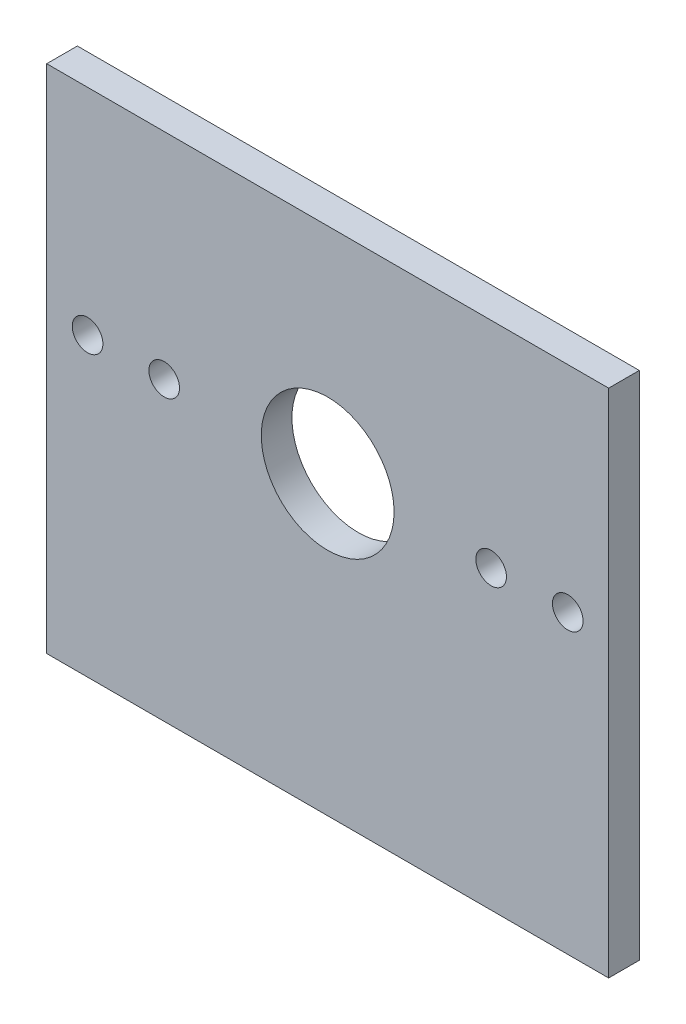
ISO-10303-21;
HEADER;
FILE_DESCRIPTION(('STEP AP214'),'2;1');
FILE_NAME('part.step','',(''),(''),'','','');
FILE_SCHEMA(('AUTOMOTIVE_DESIGN { 1 0 10303 214 1 1 1 1 }'));
ENDSEC;
DATA;
#1=APPLICATION_CONTEXT('core data for automotive mechanical design processes');
#2=APPLICATION_PROTOCOL_DEFINITION('international standard','automotive_design',2000,#1);
#3=PRODUCT_CONTEXT('',#1,'mechanical');
#4=PRODUCT('Part','Part','',(#3));
#5=PRODUCT_RELATED_PRODUCT_CATEGORY('part','',(#4));
#6=PRODUCT_DEFINITION_FORMATION('','',#4);
#7=PRODUCT_DEFINITION_CONTEXT('part definition',#1,'design');
#8=PRODUCT_DEFINITION('design','',#6,#7);
#9=PRODUCT_DEFINITION_SHAPE('','',#8);
#10=(LENGTH_UNIT() NAMED_UNIT(*) SI_UNIT(.MILLI.,.METRE.));
#11=(NAMED_UNIT(*) PLANE_ANGLE_UNIT() SI_UNIT($,.RADIAN.));
#12=(NAMED_UNIT(*) SI_UNIT($,.STERADIAN.) SOLID_ANGLE_UNIT());
#13=UNCERTAINTY_MEASURE_WITH_UNIT(LENGTH_MEASURE(1.E-05),#10,'distance_accuracy_value','');
#14=(GEOMETRIC_REPRESENTATION_CONTEXT(3) GLOBAL_UNCERTAINTY_ASSIGNED_CONTEXT((#13)) GLOBAL_UNIT_ASSIGNED_CONTEXT((#10,
#11,#12)) REPRESENTATION_CONTEXT('',''));
#15=CARTESIAN_POINT('',(0.,0.,0.));
#16=DIRECTION('',(0.,0.,1.));
#17=DIRECTION('',(1.,0.,0.));
#18=AXIS2_PLACEMENT_3D('',#15,#16,#17);
#19=CARTESIAN_POINT('',(0.,0.,3.));
#20=DIRECTION('',(0.,0.,-1.));
#21=DIRECTION('',(-1.,0.,0.));
#22=AXIS2_PLACEMENT_3D('',#19,#20,#21);
#23=PLANE('',#22);
#24=CARTESIAN_POINT('',(-16.,4.,3.));
#25=DIRECTION('',(0.,0.,1.));
#26=DIRECTION('',(1.,0.,0.));
#27=AXIS2_PLACEMENT_3D('',#24,#25,#26);
#28=CIRCLE('',#27,1.5);
#29=CARTESIAN_POINT('',(-14.5,4.,3.));
#30=VERTEX_POINT('',#29);
#31=EDGE_CURVE('E127',#30,#30,#28,.T.);
#32=ORIENTED_EDGE('',*,*,#31,.F.);
#33=EDGE_LOOP('',(#32));
#34=FACE_BOUND('',#33,.T.);
#35=CARTESIAN_POINT('',(16.,4.,3.));
#36=DIRECTION('',(0.,0.,1.));
#37=DIRECTION('',(1.,0.,0.));
#38=AXIS2_PLACEMENT_3D('',#35,#36,#37);
#39=CIRCLE('',#38,1.5);
#40=CARTESIAN_POINT('',(17.5,4.,3.));
#41=VERTEX_POINT('',#40);
#42=EDGE_CURVE('E115',#41,#41,#39,.T.);
#43=ORIENTED_EDGE('',*,*,#42,.F.);
#44=EDGE_LOOP('',(#43));
#45=FACE_BOUND('',#44,.T.);
#46=DIRECTION('',(0.,-1.,0.));
#47=VECTOR('',#46,1.);
#48=CARTESIAN_POINT('',(-27.5,-25.,3.));
#49=LINE('',#48,#47);
#50=CARTESIAN_POINT('',(-27.5,25.,3.));
#51=VERTEX_POINT('',#50);
#52=CARTESIAN_POINT('',(-27.5,-25.,3.));
#53=VERTEX_POINT('',#52);
#54=EDGE_CURVE('E85',#51,#53,#49,.T.);
#55=ORIENTED_EDGE('',*,*,#54,.T.);
#56=DIRECTION('',(1.,0.,0.));
#57=VECTOR('',#56,1.);
#58=CARTESIAN_POINT('',(-27.5,-25.,3.));
#59=LINE('',#58,#57);
#60=CARTESIAN_POINT('',(27.5,-25.,3.));
#61=VERTEX_POINT('',#60);
#62=EDGE_CURVE('E80',#53,#61,#59,.T.);
#63=ORIENTED_EDGE('',*,*,#62,.T.);
#64=DIRECTION('',(0.,1.,0.));
#65=VECTOR('',#64,1.);
#66=CARTESIAN_POINT('',(27.5,-25.,3.));
#67=LINE('',#66,#65);
#68=CARTESIAN_POINT('',(27.5,25.,3.));
#69=VERTEX_POINT('',#68);
#70=EDGE_CURVE('E83',#61,#69,#67,.T.);
#71=ORIENTED_EDGE('',*,*,#70,.T.);
#72=DIRECTION('',(-1.,0.,0.));
#73=VECTOR('',#72,1.);
#74=CARTESIAN_POINT('',(-27.5,25.,3.));
#75=LINE('',#74,#73);
#76=EDGE_CURVE('E50',#69,#51,#75,.T.);
#77=ORIENTED_EDGE('',*,*,#76,.T.);
#78=EDGE_LOOP('',(#55,#63,#71,#77));
#79=FACE_BOUND('',#78,.T.);
#80=CARTESIAN_POINT('',(0.,4.,3.));
#81=DIRECTION('',(0.,0.,1.));
#82=DIRECTION('',(1.,0.,0.));
#83=AXIS2_PLACEMENT_3D('',#80,#81,#82);
#84=CIRCLE('',#83,6.5);
#85=CARTESIAN_POINT('',(6.5,4.,3.));
#86=VERTEX_POINT('',#85);
#87=EDGE_CURVE('E100',#86,#86,#84,.T.);
#88=ORIENTED_EDGE('',*,*,#87,.F.);
#89=EDGE_LOOP('',(#88));
#90=FACE_BOUND('',#89,.T.);
#91=CARTESIAN_POINT('',(23.5,4.,3.));
#92=DIRECTION('',(0.,0.,1.));
#93=DIRECTION('',(1.,0.,0.));
#94=AXIS2_PLACEMENT_3D('',#91,#92,#93);
#95=CIRCLE('',#94,1.5);
#96=CARTESIAN_POINT('',(25.,4.,3.));
#97=VERTEX_POINT('',#96);
#98=EDGE_CURVE('E121',#97,#97,#95,.T.);
#99=ORIENTED_EDGE('',*,*,#98,.F.);
#100=EDGE_LOOP('',(#99));
#101=FACE_BOUND('',#100,.T.);
#102=CARTESIAN_POINT('',(-23.5,4.,3.));
#103=DIRECTION('',(0.,0.,1.));
#104=DIRECTION('',(1.,0.,0.));
#105=AXIS2_PLACEMENT_3D('',#102,#103,#104);
#106=CIRCLE('',#105,1.5);
#107=CARTESIAN_POINT('',(-22.,4.,3.));
#108=VERTEX_POINT('',#107);
#109=EDGE_CURVE('E133',#108,#108,#106,.T.);
#110=ORIENTED_EDGE('',*,*,#109,.F.);
#111=EDGE_LOOP('',(#110));
#112=FACE_BOUND('',#111,.T.);
#113=ADVANCED_FACE('F33',(#34,#45,#79,#90,#101,#112),#23,.F.);
#114=CARTESIAN_POINT('',(0.,0.,0.));
#115=DIRECTION('',(0.,0.,-1.));
#116=DIRECTION('',(-1.,0.,0.));
#117=AXIS2_PLACEMENT_3D('',#114,#115,#116);
#118=PLANE('',#117);
#119=CARTESIAN_POINT('',(-16.,4.,0.));
#120=DIRECTION('',(0.,0.,1.));
#121=DIRECTION('',(1.,0.,0.));
#122=AXIS2_PLACEMENT_3D('',#119,#120,#121);
#123=CIRCLE('',#122,1.5);
#124=CARTESIAN_POINT('',(-14.5,4.,0.));
#125=VERTEX_POINT('',#124);
#126=EDGE_CURVE('E130',#125,#125,#123,.T.);
#127=ORIENTED_EDGE('',*,*,#126,.T.);
#128=EDGE_LOOP('',(#127));
#129=FACE_BOUND('',#128,.T.);
#130=CARTESIAN_POINT('',(16.,4.,0.));
#131=DIRECTION('',(0.,0.,1.));
#132=DIRECTION('',(1.,0.,0.));
#133=AXIS2_PLACEMENT_3D('',#130,#131,#132);
#134=CIRCLE('',#133,1.5);
#135=CARTESIAN_POINT('',(17.5,4.,0.));
#136=VERTEX_POINT('',#135);
#137=EDGE_CURVE('E118',#136,#136,#134,.T.);
#138=ORIENTED_EDGE('',*,*,#137,.T.);
#139=EDGE_LOOP('',(#138));
#140=FACE_BOUND('',#139,.T.);
#141=DIRECTION('',(0.,-1.,0.));
#142=VECTOR('',#141,1.);
#143=CARTESIAN_POINT('',(-27.5,-25.,0.));
#144=LINE('',#143,#142);
#145=CARTESIAN_POINT('',(-27.5,25.,0.));
#146=VERTEX_POINT('',#145);
#147=CARTESIAN_POINT('',(-27.5,-25.,0.));
#148=VERTEX_POINT('',#147);
#149=EDGE_CURVE('E97',#146,#148,#144,.T.);
#150=ORIENTED_EDGE('',*,*,#149,.F.);
#151=DIRECTION('',(-1.,0.,0.));
#152=VECTOR('',#151,1.);
#153=CARTESIAN_POINT('',(-27.5,25.,0.));
#154=LINE('',#153,#152);
#155=CARTESIAN_POINT('',(27.5,25.,0.));
#156=VERTEX_POINT('',#155);
#157=EDGE_CURVE('E73',#156,#146,#154,.T.);
#158=ORIENTED_EDGE('',*,*,#157,.F.);
#159=DIRECTION('',(0.,1.,0.));
#160=VECTOR('',#159,1.);
#161=CARTESIAN_POINT('',(27.5,-25.,0.));
#162=LINE('',#161,#160);
#163=CARTESIAN_POINT('',(27.5,-25.,0.));
#164=VERTEX_POINT('',#163);
#165=EDGE_CURVE('E67',#164,#156,#162,.T.);
#166=ORIENTED_EDGE('',*,*,#165,.F.);
#167=DIRECTION('',(1.,0.,0.));
#168=VECTOR('',#167,1.);
#169=CARTESIAN_POINT('',(-27.5,-25.,0.));
#170=LINE('',#169,#168);
#171=EDGE_CURVE('E89',#148,#164,#170,.T.);
#172=ORIENTED_EDGE('',*,*,#171,.F.);
#173=EDGE_LOOP('',(#150,#158,#166,#172));
#174=FACE_BOUND('',#173,.T.);
#175=CARTESIAN_POINT('',(0.,4.,0.));
#176=DIRECTION('',(0.,0.,1.));
#177=DIRECTION('',(1.,0.,0.));
#178=AXIS2_PLACEMENT_3D('',#175,#176,#177);
#179=CIRCLE('',#178,6.5);
#180=CARTESIAN_POINT('',(6.5,4.,0.));
#181=VERTEX_POINT('',#180);
#182=EDGE_CURVE('E112',#181,#181,#179,.T.);
#183=ORIENTED_EDGE('',*,*,#182,.T.);
#184=EDGE_LOOP('',(#183));
#185=FACE_BOUND('',#184,.T.);
#186=CARTESIAN_POINT('',(23.5,4.,0.));
#187=DIRECTION('',(0.,0.,1.));
#188=DIRECTION('',(1.,0.,0.));
#189=AXIS2_PLACEMENT_3D('',#186,#187,#188);
#190=CIRCLE('',#189,1.5);
#191=CARTESIAN_POINT('',(25.,4.,0.));
#192=VERTEX_POINT('',#191);
#193=EDGE_CURVE('E124',#192,#192,#190,.T.);
#194=ORIENTED_EDGE('',*,*,#193,.T.);
#195=EDGE_LOOP('',(#194));
#196=FACE_BOUND('',#195,.T.);
#197=CARTESIAN_POINT('',(-23.5,4.,0.));
#198=DIRECTION('',(0.,0.,1.));
#199=DIRECTION('',(1.,0.,0.));
#200=AXIS2_PLACEMENT_3D('',#197,#198,#199);
#201=CIRCLE('',#200,1.5);
#202=CARTESIAN_POINT('',(-22.,4.,0.));
#203=VERTEX_POINT('',#202);
#204=EDGE_CURVE('E136',#203,#203,#201,.T.);
#205=ORIENTED_EDGE('',*,*,#204,.T.);
#206=EDGE_LOOP('',(#205));
#207=FACE_BOUND('',#206,.T.);
#208=ADVANCED_FACE('F108',(#129,#140,#174,#185,#196,#207),#118,.T.);
#209=CARTESIAN_POINT('',(-27.5,-25.,3.));
#210=DIRECTION('',(1.,0.,0.));
#211=DIRECTION('',(0.,0.,-1.));
#212=AXIS2_PLACEMENT_3D('',#209,#210,#211);
#213=PLANE('',#212);
#214=ORIENTED_EDGE('',*,*,#149,.T.);
#215=DIRECTION('',(0.,0.,-1.));
#216=VECTOR('',#215,1.);
#217=CARTESIAN_POINT('',(-27.5,-25.,3.));
#218=LINE('',#217,#216);
#219=EDGE_CURVE('E11',#53,#148,#218,.T.);
#220=ORIENTED_EDGE('',*,*,#219,.F.);
#221=ORIENTED_EDGE('',*,*,#54,.F.);
#222=DIRECTION('',(0.,0.,-1.));
#223=VECTOR('',#222,1.);
#224=CARTESIAN_POINT('',(-27.5,25.,3.));
#225=LINE('',#224,#223);
#226=EDGE_CURVE('E93',#51,#146,#225,.T.);
#227=ORIENTED_EDGE('',*,*,#226,.T.);
#228=EDGE_LOOP('',(#214,#220,#221,#227));
#229=FACE_BOUND('',#228,.T.);
#230=ADVANCED_FACE('F35',(#229),#213,.F.);
#231=CARTESIAN_POINT('',(-27.5,-25.,3.));
#232=DIRECTION('',(0.,1.,0.));
#233=DIRECTION('',(0.,0.,1.));
#234=AXIS2_PLACEMENT_3D('',#231,#232,#233);
#235=PLANE('',#234);
#236=ORIENTED_EDGE('',*,*,#171,.T.);
#237=DIRECTION('',(0.,0.,-1.));
#238=VECTOR('',#237,1.);
#239=CARTESIAN_POINT('',(27.5,-25.,3.));
#240=LINE('',#239,#238);
#241=EDGE_CURVE('E42',#61,#164,#240,.T.);
#242=ORIENTED_EDGE('',*,*,#241,.F.);
#243=ORIENTED_EDGE('',*,*,#62,.F.);
#244=ORIENTED_EDGE('',*,*,#219,.T.);
#245=EDGE_LOOP('',(#236,#242,#243,#244));
#246=FACE_BOUND('',#245,.T.);
#247=ADVANCED_FACE('F88',(#246),#235,.F.);
#248=CARTESIAN_POINT('',(27.5,-25.,3.));
#249=DIRECTION('',(-1.,0.,0.));
#250=DIRECTION('',(0.,0.,1.));
#251=AXIS2_PLACEMENT_3D('',#248,#249,#250);
#252=PLANE('',#251);
#253=ORIENTED_EDGE('',*,*,#165,.T.);
#254=DIRECTION('',(0.,0.,-1.));
#255=VECTOR('',#254,1.);
#256=CARTESIAN_POINT('',(27.5,25.,3.));
#257=LINE('',#256,#255);
#258=EDGE_CURVE('E90',#69,#156,#257,.T.);
#259=ORIENTED_EDGE('',*,*,#258,.F.);
#260=ORIENTED_EDGE('',*,*,#70,.F.);
#261=ORIENTED_EDGE('',*,*,#241,.T.);
#262=EDGE_LOOP('',(#253,#259,#260,#261));
#263=FACE_BOUND('',#262,.T.);
#264=ADVANCED_FACE('F91',(#263),#252,.F.);
#265=CARTESIAN_POINT('',(-27.5,25.,3.));
#266=DIRECTION('',(0.,-1.,0.));
#267=DIRECTION('',(0.,0.,-1.));
#268=AXIS2_PLACEMENT_3D('',#265,#266,#267);
#269=PLANE('',#268);
#270=ORIENTED_EDGE('',*,*,#157,.T.);
#271=ORIENTED_EDGE('',*,*,#226,.F.);
#272=ORIENTED_EDGE('',*,*,#76,.F.);
#273=ORIENTED_EDGE('',*,*,#258,.T.);
#274=EDGE_LOOP('',(#270,#271,#272,#273));
#275=FACE_BOUND('',#274,.T.);
#276=ADVANCED_FACE('F105',(#275),#269,.F.);
#277=CARTESIAN_POINT('',(0.,4.,3.));
#278=DIRECTION('',(0.,0.,-1.));
#279=DIRECTION('',(-1.,0.,0.));
#280=AXIS2_PLACEMENT_3D('',#277,#278,#279);
#281=CYLINDRICAL_SURFACE('',#280,6.5);
#282=ORIENTED_EDGE('',*,*,#87,.T.);
#283=EDGE_LOOP('',(#282));
#284=FACE_BOUND('',#283,.T.);
#285=ORIENTED_EDGE('',*,*,#182,.F.);
#286=EDGE_LOOP('',(#285));
#287=FACE_BOUND('',#286,.T.);
#288=ADVANCED_FACE('F156',(#284,#287),#281,.F.);
#289=CARTESIAN_POINT('',(16.,4.,3.));
#290=DIRECTION('',(0.,0.,-1.));
#291=DIRECTION('',(-1.,0.,0.));
#292=AXIS2_PLACEMENT_3D('',#289,#290,#291);
#293=CYLINDRICAL_SURFACE('',#292,1.5);
#294=ORIENTED_EDGE('',*,*,#42,.T.);
#295=EDGE_LOOP('',(#294));
#296=FACE_BOUND('',#295,.T.);
#297=ORIENTED_EDGE('',*,*,#137,.F.);
#298=EDGE_LOOP('',(#297));
#299=FACE_BOUND('',#298,.T.);
#300=ADVANCED_FACE('F202',(#296,#299),#293,.F.);
#301=CARTESIAN_POINT('',(23.5,4.,3.));
#302=DIRECTION('',(0.,0.,-1.));
#303=DIRECTION('',(-1.,0.,0.));
#304=AXIS2_PLACEMENT_3D('',#301,#302,#303);
#305=CYLINDRICAL_SURFACE('',#304,1.5);
#306=ORIENTED_EDGE('',*,*,#98,.T.);
#307=EDGE_LOOP('',(#306));
#308=FACE_BOUND('',#307,.T.);
#309=ORIENTED_EDGE('',*,*,#193,.F.);
#310=EDGE_LOOP('',(#309));
#311=FACE_BOUND('',#310,.T.);
#312=ADVANCED_FACE('F210',(#308,#311),#305,.F.);
#313=CARTESIAN_POINT('',(-16.,4.,3.));
#314=DIRECTION('',(0.,0.,-1.));
#315=DIRECTION('',(-1.,0.,0.));
#316=AXIS2_PLACEMENT_3D('',#313,#314,#315);
#317=CYLINDRICAL_SURFACE('',#316,1.5);
#318=ORIENTED_EDGE('',*,*,#31,.T.);
#319=EDGE_LOOP('',(#318));
#320=FACE_BOUND('',#319,.T.);
#321=ORIENTED_EDGE('',*,*,#126,.F.);
#322=EDGE_LOOP('',(#321));
#323=FACE_BOUND('',#322,.T.);
#324=ADVANCED_FACE('F218',(#320,#323),#317,.F.);
#325=CARTESIAN_POINT('',(-23.5,4.,3.));
#326=DIRECTION('',(0.,0.,-1.));
#327=DIRECTION('',(-1.,0.,0.));
#328=AXIS2_PLACEMENT_3D('',#325,#326,#327);
#329=CYLINDRICAL_SURFACE('',#328,1.5);
#330=ORIENTED_EDGE('',*,*,#109,.T.);
#331=EDGE_LOOP('',(#330));
#332=FACE_BOUND('',#331,.T.);
#333=ORIENTED_EDGE('',*,*,#204,.F.);
#334=EDGE_LOOP('',(#333));
#335=FACE_BOUND('',#334,.T.);
#336=ADVANCED_FACE('F142',(#332,#335),#329,.F.);
#337=CLOSED_SHELL('',(#113,#208,#230,#247,#264,#276,#288,#300,#312,#324,#336));
#338=MANIFOLD_SOLID_BREP('B2',#337);
#339=ADVANCED_BREP_SHAPE_REPRESENTATION('',(#18,#338),#14);
#340=SHAPE_DEFINITION_REPRESENTATION(#9,#339);
ENDSEC;
END-ISO-10303-21;
